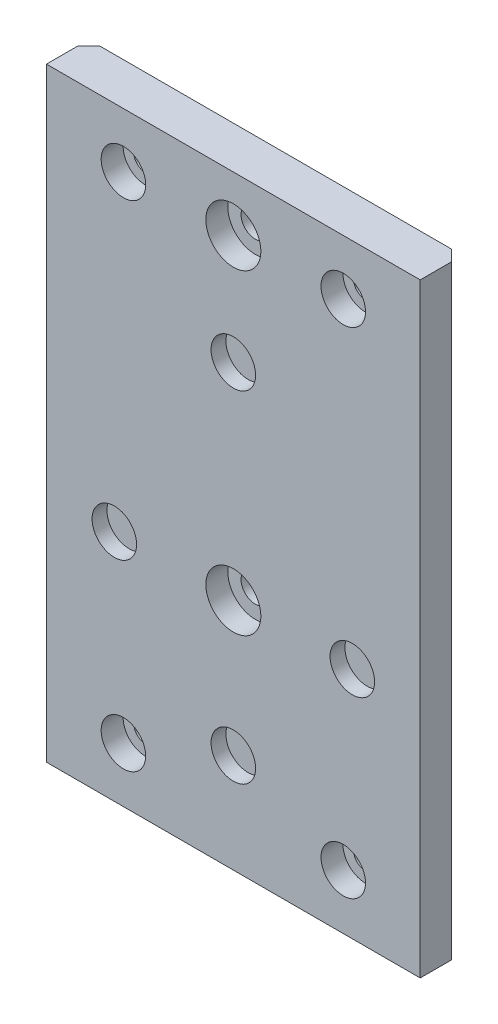
ISO-10303-21;
HEADER;
FILE_DESCRIPTION(('STEP AP214'),'2;1');
FILE_NAME('part.step','',(''),(''),'','','');
FILE_SCHEMA(('AUTOMOTIVE_DESIGN { 1 0 10303 214 1 1 1 1 }'));
ENDSEC;
DATA;
#1=APPLICATION_CONTEXT('core data for automotive mechanical design processes');
#2=APPLICATION_PROTOCOL_DEFINITION('international standard','automotive_design',2000,#1);
#3=PRODUCT_CONTEXT('',#1,'mechanical');
#4=PRODUCT('Part','Part','',(#3));
#5=PRODUCT_RELATED_PRODUCT_CATEGORY('part','',(#4));
#6=PRODUCT_DEFINITION_FORMATION('','',#4);
#7=PRODUCT_DEFINITION_CONTEXT('part definition',#1,'design');
#8=PRODUCT_DEFINITION('design','',#6,#7);
#9=PRODUCT_DEFINITION_SHAPE('','',#8);
#10=(LENGTH_UNIT() NAMED_UNIT(*) SI_UNIT(.MILLI.,.METRE.));
#11=(NAMED_UNIT(*) PLANE_ANGLE_UNIT() SI_UNIT($,.RADIAN.));
#12=(NAMED_UNIT(*) SI_UNIT($,.STERADIAN.) SOLID_ANGLE_UNIT());
#13=UNCERTAINTY_MEASURE_WITH_UNIT(LENGTH_MEASURE(1.E-05),#10,'distance_accuracy_value','');
#14=(GEOMETRIC_REPRESENTATION_CONTEXT(3) GLOBAL_UNCERTAINTY_ASSIGNED_CONTEXT((#13)) GLOBAL_UNIT_ASSIGNED_CONTEXT((#10,
#11,#12)) REPRESENTATION_CONTEXT('',''));
#15=CARTESIAN_POINT('',(0.,0.,0.));
#16=DIRECTION('',(0.,0.,1.));
#17=DIRECTION('',(1.,0.,0.));
#18=AXIS2_PLACEMENT_3D('',#15,#16,#17);
#19=CARTESIAN_POINT('',(0.,-36.95,7.7));
#20=DIRECTION('',(0.,0.,-1.));
#21=DIRECTION('',(-1.,0.,0.));
#22=AXIS2_PLACEMENT_3D('',#19,#20,#21);
#23=CYLINDRICAL_SURFACE('',#22,4.05);
#24=CARTESIAN_POINT('',(0.,-36.95,7.7));
#25=DIRECTION('',(0.,0.,1.));
#26=DIRECTION('',(1.,0.,0.));
#27=AXIS2_PLACEMENT_3D('',#24,#25,#26);
#28=CIRCLE('',#27,4.05);
#29=CARTESIAN_POINT('',(4.05,-36.95,7.7));
#30=VERTEX_POINT('',#29);
#31=EDGE_CURVE('E191',#30,#30,#28,.T.);
#32=ORIENTED_EDGE('',*,*,#31,.T.);
#33=EDGE_LOOP('',(#32));
#34=FACE_BOUND('',#33,.T.);
#35=CARTESIAN_POINT('',(0.,-36.95,5.));
#36=DIRECTION('',(0.,0.,-1.));
#37=DIRECTION('',(-1.,0.,0.));
#38=AXIS2_PLACEMENT_3D('',#35,#36,#37);
#39=CIRCLE('',#38,4.05);
#40=CARTESIAN_POINT('',(-4.05,-36.95,5.));
#41=VERTEX_POINT('',#40);
#42=EDGE_CURVE('E136',#41,#41,#39,.T.);
#43=ORIENTED_EDGE('',*,*,#42,.T.);
#44=EDGE_LOOP('',(#43));
#45=FACE_BOUND('',#44,.T.);
#46=ADVANCED_FACE('F32',(#34,#45),#23,.F.);
#47=CARTESIAN_POINT('',(-21.650635094611,-12.5,7.7));
#48=DIRECTION('',(0.,0.,-1.));
#49=DIRECTION('',(-1.,0.,0.));
#50=AXIS2_PLACEMENT_3D('',#47,#48,#49);
#51=CYLINDRICAL_SURFACE('',#50,4.05);
#52=CARTESIAN_POINT('',(-21.650635094611,-12.5,7.7));
#53=DIRECTION('',(0.,0.,1.));
#54=DIRECTION('',(1.,0.,0.));
#55=AXIS2_PLACEMENT_3D('',#52,#53,#54);
#56=CIRCLE('',#55,4.05);
#57=CARTESIAN_POINT('',(-17.600635094611,-12.5,7.7));
#58=VERTEX_POINT('',#57);
#59=EDGE_CURVE('E199',#58,#58,#56,.T.);
#60=ORIENTED_EDGE('',*,*,#59,.T.);
#61=EDGE_LOOP('',(#60));
#62=FACE_BOUND('',#61,.T.);
#63=CARTESIAN_POINT('',(-21.650635094611,-12.5,5.));
#64=DIRECTION('',(0.,0.,-1.));
#65=DIRECTION('',(-1.,0.,0.));
#66=AXIS2_PLACEMENT_3D('',#63,#64,#65);
#67=CIRCLE('',#66,4.05);
#68=CARTESIAN_POINT('',(-25.700635094611,-12.5,5.));
#69=VERTEX_POINT('',#68);
#70=EDGE_CURVE('E133',#69,#69,#67,.T.);
#71=ORIENTED_EDGE('',*,*,#70,.T.);
#72=EDGE_LOOP('',(#71));
#73=FACE_BOUND('',#72,.T.);
#74=ADVANCED_FACE('F287',(#62,#73),#51,.F.);
#75=CARTESIAN_POINT('',(0.,25.,7.7));
#76=DIRECTION('',(0.,0.,-1.));
#77=DIRECTION('',(-1.,0.,0.));
#78=AXIS2_PLACEMENT_3D('',#75,#76,#77);
#79=CYLINDRICAL_SURFACE('',#78,4.05);
#80=CARTESIAN_POINT('',(0.,25.,7.7));
#81=DIRECTION('',(0.,0.,1.));
#82=DIRECTION('',(1.,0.,0.));
#83=AXIS2_PLACEMENT_3D('',#80,#81,#82);
#84=CIRCLE('',#83,4.05);
#85=CARTESIAN_POINT('',(4.04999999999999,25.,7.7));
#86=VERTEX_POINT('',#85);
#87=EDGE_CURVE('E202',#86,#86,#84,.T.);
#88=ORIENTED_EDGE('',*,*,#87,.T.);
#89=EDGE_LOOP('',(#88));
#90=FACE_BOUND('',#89,.T.);
#91=CARTESIAN_POINT('',(0.,25.,5.));
#92=DIRECTION('',(0.,0.,-1.));
#93=DIRECTION('',(-1.,0.,0.));
#94=AXIS2_PLACEMENT_3D('',#91,#92,#93);
#95=CIRCLE('',#94,4.05);
#96=CARTESIAN_POINT('',(-4.05000000000001,25.,5.));
#97=VERTEX_POINT('',#96);
#98=EDGE_CURVE('E130',#97,#97,#95,.T.);
#99=ORIENTED_EDGE('',*,*,#98,.T.);
#100=EDGE_LOOP('',(#99));
#101=FACE_BOUND('',#100,.T.);
#102=ADVANCED_FACE('F293',(#90,#101),#79,.F.);
#103=CARTESIAN_POINT('',(21.650635094611,-12.5,7.7));
#104=DIRECTION('',(0.,0.,-1.));
#105=DIRECTION('',(-1.,0.,0.));
#106=AXIS2_PLACEMENT_3D('',#103,#104,#105);
#107=CYLINDRICAL_SURFACE('',#106,4.05);
#108=CARTESIAN_POINT('',(21.650635094611,-12.5,7.7));
#109=DIRECTION('',(0.,0.,1.));
#110=DIRECTION('',(1.,0.,0.));
#111=AXIS2_PLACEMENT_3D('',#108,#109,#110);
#112=CIRCLE('',#111,4.05);
#113=CARTESIAN_POINT('',(25.700635094611,-12.5,7.7));
#114=VERTEX_POINT('',#113);
#115=EDGE_CURVE('E205',#114,#114,#112,.T.);
#116=ORIENTED_EDGE('',*,*,#115,.T.);
#117=EDGE_LOOP('',(#116));
#118=FACE_BOUND('',#117,.T.);
#119=CARTESIAN_POINT('',(21.650635094611,-12.5,5.));
#120=DIRECTION('',(0.,0.,-1.));
#121=DIRECTION('',(-1.,0.,0.));
#122=AXIS2_PLACEMENT_3D('',#119,#120,#121);
#123=CIRCLE('',#122,4.05);
#124=CARTESIAN_POINT('',(17.600635094611,-12.5,5.));
#125=VERTEX_POINT('',#124);
#126=EDGE_CURVE('E126',#125,#125,#123,.T.);
#127=ORIENTED_EDGE('',*,*,#126,.T.);
#128=EDGE_LOOP('',(#127));
#129=FACE_BOUND('',#128,.T.);
#130=ADVANCED_FACE('F303',(#118,#129),#107,.F.);
#131=CARTESIAN_POINT('',(0.,0.,7.7));
#132=DIRECTION('',(0.,0.,1.));
#133=DIRECTION('',(1.,0.,0.));
#134=AXIS2_PLACEMENT_3D('',#131,#132,#133);
#135=PLANE('',#134);
#136=CARTESIAN_POINT('',(0.,45.,7.7));
#137=DIRECTION('',(0.,0.,-1.));
#138=DIRECTION('',(-1.,0.,0.));
#139=AXIS2_PLACEMENT_3D('',#136,#137,#138);
#140=CIRCLE('',#139,5.);
#141=CARTESIAN_POINT('',(-5.00000000000001,45.,7.7));
#142=VERTEX_POINT('',#141);
#143=EDGE_CURVE('E240',#142,#142,#140,.T.);
#144=ORIENTED_EDGE('',*,*,#143,.T.);
#145=EDGE_LOOP('',(#144));
#146=FACE_BOUND('',#145,.T.);
#147=CARTESIAN_POINT('',(-20.,-45.,7.7));
#148=DIRECTION('',(0.,0.,-1.));
#149=DIRECTION('',(-1.,0.,0.));
#150=AXIS2_PLACEMENT_3D('',#147,#148,#149);
#151=CIRCLE('',#150,4.05);
#152=CARTESIAN_POINT('',(-24.05,-45.,7.7));
#153=VERTEX_POINT('',#152);
#154=EDGE_CURVE('E247',#153,#153,#151,.T.);
#155=ORIENTED_EDGE('',*,*,#154,.T.);
#156=EDGE_LOOP('',(#155));
#157=FACE_BOUND('',#156,.T.);
#158=CARTESIAN_POINT('',(20.,-45.,7.7));
#159=DIRECTION('',(0.,0.,-1.));
#160=DIRECTION('',(-1.,0.,0.));
#161=AXIS2_PLACEMENT_3D('',#158,#159,#160);
#162=CIRCLE('',#161,4.05);
#163=CARTESIAN_POINT('',(15.95,-45.,7.7));
#164=VERTEX_POINT('',#163);
#165=EDGE_CURVE('E246',#164,#164,#162,.T.);
#166=ORIENTED_EDGE('',*,*,#165,.T.);
#167=EDGE_LOOP('',(#166));
#168=FACE_BOUND('',#167,.T.);
#169=CARTESIAN_POINT('',(-20.,45.,7.7));
#170=DIRECTION('',(0.,0.,-1.));
#171=DIRECTION('',(-1.,0.,0.));
#172=AXIS2_PLACEMENT_3D('',#169,#170,#171);
#173=CIRCLE('',#172,4.05);
#174=CARTESIAN_POINT('',(-24.05,45.,7.7));
#175=VERTEX_POINT('',#174);
#176=EDGE_CURVE('E258',#175,#175,#173,.T.);
#177=ORIENTED_EDGE('',*,*,#176,.T.);
#178=EDGE_LOOP('',(#177));
#179=FACE_BOUND('',#178,.T.);
#180=CARTESIAN_POINT('',(0.,-12.5,7.7));
#181=DIRECTION('',(0.,0.,-1.));
#182=DIRECTION('',(-1.,0.,0.));
#183=AXIS2_PLACEMENT_3D('',#180,#181,#182);
#184=CIRCLE('',#183,5.);
#185=CARTESIAN_POINT('',(-5.00000000000001,-12.5,7.7));
#186=VERTEX_POINT('',#185);
#187=EDGE_CURVE('E232',#186,#186,#184,.T.);
#188=ORIENTED_EDGE('',*,*,#187,.T.);
#189=EDGE_LOOP('',(#188));
#190=FACE_BOUND('',#189,.T.);
#191=CARTESIAN_POINT('',(20.,45.,7.7));
#192=DIRECTION('',(0.,0.,-1.));
#193=DIRECTION('',(-1.,0.,0.));
#194=AXIS2_PLACEMENT_3D('',#191,#192,#193);
#195=CIRCLE('',#194,4.05);
#196=CARTESIAN_POINT('',(15.95,45.,7.7));
#197=VERTEX_POINT('',#196);
#198=EDGE_CURVE('E194',#197,#197,#195,.T.);
#199=ORIENTED_EDGE('',*,*,#198,.T.);
#200=EDGE_LOOP('',(#199));
#201=FACE_BOUND('',#200,.T.);
#202=ORIENTED_EDGE('',*,*,#59,.F.);
#203=EDGE_LOOP('',(#202));
#204=FACE_BOUND('',#203,.T.);
#205=ORIENTED_EDGE('',*,*,#115,.F.);
#206=EDGE_LOOP('',(#205));
#207=FACE_BOUND('',#206,.T.);
#208=DIRECTION('',(0.,1.,0.));
#209=VECTOR('',#208,1.);
#210=CARTESIAN_POINT('',(34.,55.,7.7));
#211=LINE('',#210,#209);
#212=CARTESIAN_POINT('',(34.,-55.,7.7));
#213=VERTEX_POINT('',#212);
#214=CARTESIAN_POINT('',(34.,55.,7.7));
#215=VERTEX_POINT('',#214);
#216=EDGE_CURVE('E110',#213,#215,#211,.T.);
#217=ORIENTED_EDGE('',*,*,#216,.T.);
#218=DIRECTION('',(-1.,0.,0.));
#219=VECTOR('',#218,1.);
#220=CARTESIAN_POINT('',(-34.,55.,7.7));
#221=LINE('',#220,#219);
#222=CARTESIAN_POINT('',(-34.,55.,7.7));
#223=VERTEX_POINT('',#222);
#224=EDGE_CURVE('E213',#215,#223,#221,.T.);
#225=ORIENTED_EDGE('',*,*,#224,.T.);
#226=DIRECTION('',(0.,-1.,0.));
#227=VECTOR('',#226,1.);
#228=CARTESIAN_POINT('',(-34.,55.,7.7));
#229=LINE('',#228,#227);
#230=CARTESIAN_POINT('',(-34.,-55.,7.7));
#231=VERTEX_POINT('',#230);
#232=EDGE_CURVE('E214',#223,#231,#229,.T.);
#233=ORIENTED_EDGE('',*,*,#232,.T.);
#234=DIRECTION('',(1.,0.,0.));
#235=VECTOR('',#234,1.);
#236=CARTESIAN_POINT('',(-34.,-55.,7.7));
#237=LINE('',#236,#235);
#238=EDGE_CURVE('E116',#231,#213,#237,.T.);
#239=ORIENTED_EDGE('',*,*,#238,.T.);
#240=EDGE_LOOP('',(#217,#225,#233,#239));
#241=FACE_BOUND('',#240,.T.);
#242=ORIENTED_EDGE('',*,*,#87,.F.);
#243=EDGE_LOOP('',(#242));
#244=FACE_BOUND('',#243,.T.);
#245=ORIENTED_EDGE('',*,*,#31,.F.);
#246=EDGE_LOOP('',(#245));
#247=FACE_BOUND('',#246,.T.);
#248=ADVANCED_FACE('F170',(#146,#157,#168,#179,#190,#201,#204,#207,#241,#244,#247),#135,.T.);
#249=CARTESIAN_POINT('',(0.,0.,0.));
#250=DIRECTION('',(0.,0.,1.));
#251=DIRECTION('',(1.,0.,0.));
#252=AXIS2_PLACEMENT_3D('',#249,#250,#251);
#253=PLANE('',#252);
#254=DIRECTION('',(1.,0.,0.));
#255=VECTOR('',#254,1.);
#256=CARTESIAN_POINT('',(-34.,-55.,0.));
#257=LINE('',#256,#255);
#258=CARTESIAN_POINT('',(-32.,-55.,0.));
#259=VERTEX_POINT('',#258);
#260=CARTESIAN_POINT('',(32.,-55.,0.));
#261=VERTEX_POINT('',#260);
#262=EDGE_CURVE('E103',#259,#261,#257,.T.);
#263=ORIENTED_EDGE('',*,*,#262,.F.);
#264=DIRECTION('',(0.,-1.,0.));
#265=VECTOR('',#264,1.);
#266=CARTESIAN_POINT('',(-32.,55.,0.));
#267=LINE('',#266,#265);
#268=CARTESIAN_POINT('',(-32.,55.,0.));
#269=VERTEX_POINT('',#268);
#270=EDGE_CURVE('E57',#269,#259,#267,.T.);
#271=ORIENTED_EDGE('',*,*,#270,.F.);
#272=DIRECTION('',(-1.,0.,0.));
#273=VECTOR('',#272,1.);
#274=CARTESIAN_POINT('',(-34.,55.,0.));
#275=LINE('',#274,#273);
#276=CARTESIAN_POINT('',(32.,55.,0.));
#277=VERTEX_POINT('',#276);
#278=EDGE_CURVE('E101',#277,#269,#275,.T.);
#279=ORIENTED_EDGE('',*,*,#278,.F.);
#280=DIRECTION('',(0.,-1.,0.));
#281=VECTOR('',#280,1.);
#282=CARTESIAN_POINT('',(32.,55.,0.));
#283=LINE('',#282,#281);
#284=EDGE_CURVE('E229',#277,#261,#283,.T.);
#285=ORIENTED_EDGE('',*,*,#284,.T.);
#286=EDGE_LOOP('',(#263,#271,#279,#285));
#287=FACE_BOUND('',#286,.T.);
#288=CARTESIAN_POINT('',(20.,45.,0.));
#289=DIRECTION('',(0.,0.,1.));
#290=DIRECTION('',(1.,0.,0.));
#291=AXIS2_PLACEMENT_3D('',#288,#289,#290);
#292=CIRCLE('',#291,2.1);
#293=CARTESIAN_POINT('',(22.1,45.,0.));
#294=VERTEX_POINT('',#293);
#295=EDGE_CURVE('E108',#294,#294,#292,.T.);
#296=ORIENTED_EDGE('',*,*,#295,.T.);
#297=EDGE_LOOP('',(#296));
#298=FACE_BOUND('',#297,.T.);
#299=CARTESIAN_POINT('',(-20.,45.,0.));
#300=DIRECTION('',(0.,0.,1.));
#301=DIRECTION('',(1.,0.,0.));
#302=AXIS2_PLACEMENT_3D('',#299,#300,#301);
#303=CIRCLE('',#302,2.1);
#304=CARTESIAN_POINT('',(-17.9,45.,0.));
#305=VERTEX_POINT('',#304);
#306=EDGE_CURVE('E113',#305,#305,#303,.T.);
#307=ORIENTED_EDGE('',*,*,#306,.T.);
#308=EDGE_LOOP('',(#307));
#309=FACE_BOUND('',#308,.T.);
#310=CARTESIAN_POINT('',(20.,-45.,0.));
#311=DIRECTION('',(0.,0.,1.));
#312=DIRECTION('',(1.,0.,0.));
#313=AXIS2_PLACEMENT_3D('',#310,#311,#312);
#314=CIRCLE('',#313,2.1);
#315=CARTESIAN_POINT('',(22.1,-45.,0.));
#316=VERTEX_POINT('',#315);
#317=EDGE_CURVE('E178',#316,#316,#314,.T.);
#318=ORIENTED_EDGE('',*,*,#317,.T.);
#319=EDGE_LOOP('',(#318));
#320=FACE_BOUND('',#319,.T.);
#321=CARTESIAN_POINT('',(-20.,-45.,0.));
#322=DIRECTION('',(0.,0.,1.));
#323=DIRECTION('',(1.,0.,0.));
#324=AXIS2_PLACEMENT_3D('',#321,#322,#323);
#325=CIRCLE('',#324,2.1);
#326=CARTESIAN_POINT('',(-17.9,-45.,0.));
#327=VERTEX_POINT('',#326);
#328=EDGE_CURVE('E182',#327,#327,#325,.T.);
#329=ORIENTED_EDGE('',*,*,#328,.T.);
#330=EDGE_LOOP('',(#329));
#331=FACE_BOUND('',#330,.T.);
#332=CARTESIAN_POINT('',(0.,45.,0.));
#333=DIRECTION('',(0.,0.,1.));
#334=DIRECTION('',(1.,0.,0.));
#335=AXIS2_PLACEMENT_3D('',#332,#333,#334);
#336=CIRCLE('',#335,2.6);
#337=CARTESIAN_POINT('',(2.59999999999999,45.,0.));
#338=VERTEX_POINT('',#337);
#339=EDGE_CURVE('E186',#338,#338,#336,.T.);
#340=ORIENTED_EDGE('',*,*,#339,.T.);
#341=EDGE_LOOP('',(#340));
#342=FACE_BOUND('',#341,.T.);
#343=CARTESIAN_POINT('',(0.,-12.5,0.));
#344=DIRECTION('',(0.,0.,1.));
#345=DIRECTION('',(1.,0.,0.));
#346=AXIS2_PLACEMENT_3D('',#343,#344,#345);
#347=CIRCLE('',#346,2.6);
#348=CARTESIAN_POINT('',(2.59999999999999,-12.5,0.));
#349=VERTEX_POINT('',#348);
#350=EDGE_CURVE('E129',#349,#349,#347,.T.);
#351=ORIENTED_EDGE('',*,*,#350,.T.);
#352=EDGE_LOOP('',(#351));
#353=FACE_BOUND('',#352,.T.);
#354=ADVANCED_FACE('F98',(#287,#298,#309,#320,#331,#342,#353),#253,.F.);
#355=CARTESIAN_POINT('',(34.,55.,7.7));
#356=DIRECTION('',(-1.,0.,0.));
#357=DIRECTION('',(0.,-1.,0.));
#358=AXIS2_PLACEMENT_3D('',#355,#356,#357);
#359=PLANE('',#358);
#360=DIRECTION('',(0.,0.,-1.));
#361=VECTOR('',#360,1.);
#362=CARTESIAN_POINT('',(34.,-55.,7.7));
#363=LINE('',#362,#361);
#364=CARTESIAN_POINT('',(34.,-55.,1.99999999999995));
#365=VERTEX_POINT('',#364);
#366=EDGE_CURVE('E119',#213,#365,#363,.T.);
#367=ORIENTED_EDGE('',*,*,#366,.T.);
#368=DIRECTION('',(0.,-1.,0.));
#369=VECTOR('',#368,1.);
#370=CARTESIAN_POINT('',(34.,55.,1.99999999999995));
#371=LINE('',#370,#369);
#372=CARTESIAN_POINT('',(34.,55.,1.99999999999995));
#373=VERTEX_POINT('',#372);
#374=EDGE_CURVE('E49',#373,#365,#371,.T.);
#375=ORIENTED_EDGE('',*,*,#374,.F.);
#376=DIRECTION('',(0.,0.,-1.));
#377=VECTOR('',#376,1.);
#378=CARTESIAN_POINT('',(34.,55.,7.7));
#379=LINE('',#378,#377);
#380=EDGE_CURVE('E11',#215,#373,#379,.T.);
#381=ORIENTED_EDGE('',*,*,#380,.F.);
#382=ORIENTED_EDGE('',*,*,#216,.F.);
#383=EDGE_LOOP('',(#367,#375,#381,#382));
#384=FACE_BOUND('',#383,.T.);
#385=ADVANCED_FACE('F34',(#384),#359,.F.);
#386=CARTESIAN_POINT('',(-34.,55.,7.7));
#387=DIRECTION('',(0.,-1.,0.));
#388=DIRECTION('',(0.,0.,-1.));
#389=AXIS2_PLACEMENT_3D('',#386,#387,#388);
#390=PLANE('',#389);
#391=ORIENTED_EDGE('',*,*,#278,.T.);
#392=DIRECTION('',(-0.707106781186541,0.,0.707106781186554));
#393=VECTOR('',#392,1.);
#394=CARTESIAN_POINT('',(-32.,55.,0.));
#395=LINE('',#394,#393);
#396=CARTESIAN_POINT('',(-34.,55.,2.00000000000004));
#397=VERTEX_POINT('',#396);
#398=EDGE_CURVE('E85',#269,#397,#395,.T.);
#399=ORIENTED_EDGE('',*,*,#398,.T.);
#400=DIRECTION('',(0.,0.,-1.));
#401=VECTOR('',#400,1.);
#402=CARTESIAN_POINT('',(-34.,55.,7.7));
#403=LINE('',#402,#401);
#404=EDGE_CURVE('E41',#223,#397,#403,.T.);
#405=ORIENTED_EDGE('',*,*,#404,.F.);
#406=ORIENTED_EDGE('',*,*,#224,.F.);
#407=ORIENTED_EDGE('',*,*,#380,.T.);
#408=DIRECTION('',(-0.707106781186556,0.,-0.707106781186539));
#409=VECTOR('',#408,1.);
#410=CARTESIAN_POINT('',(32.,55.,0.));
#411=LINE('',#410,#409);
#412=EDGE_CURVE('E107',#373,#277,#411,.T.);
#413=ORIENTED_EDGE('',*,*,#412,.T.);
#414=EDGE_LOOP('',(#391,#399,#405,#406,#407,#413));
#415=FACE_BOUND('',#414,.T.);
#416=ADVANCED_FACE('F106',(#415),#390,.F.);
#417=CARTESIAN_POINT('',(-34.,55.,7.7));
#418=DIRECTION('',(1.,0.,0.));
#419=DIRECTION('',(0.,1.,0.));
#420=AXIS2_PLACEMENT_3D('',#417,#418,#419);
#421=PLANE('',#420);
#422=ORIENTED_EDGE('',*,*,#404,.T.);
#423=DIRECTION('',(0.,-1.,0.));
#424=VECTOR('',#423,1.);
#425=CARTESIAN_POINT('',(-34.,55.,2.00000000000004));
#426=LINE('',#425,#424);
#427=CARTESIAN_POINT('',(-34.,-55.,2.00000000000004));
#428=VERTEX_POINT('',#427);
#429=EDGE_CURVE('E88',#397,#428,#426,.T.);
#430=ORIENTED_EDGE('',*,*,#429,.T.);
#431=DIRECTION('',(0.,0.,-1.));
#432=VECTOR('',#431,1.);
#433=CARTESIAN_POINT('',(-34.,-55.,7.7));
#434=LINE('',#433,#432);
#435=EDGE_CURVE('E122',#231,#428,#434,.T.);
#436=ORIENTED_EDGE('',*,*,#435,.F.);
#437=ORIENTED_EDGE('',*,*,#232,.F.);
#438=EDGE_LOOP('',(#422,#430,#436,#437));
#439=FACE_BOUND('',#438,.T.);
#440=ADVANCED_FACE('F227',(#439),#421,.F.);
#441=CARTESIAN_POINT('',(-34.,-55.,7.7));
#442=DIRECTION('',(0.,1.,0.));
#443=DIRECTION('',(0.,0.,1.));
#444=AXIS2_PLACEMENT_3D('',#441,#442,#443);
#445=PLANE('',#444);
#446=ORIENTED_EDGE('',*,*,#435,.T.);
#447=DIRECTION('',(-0.707106781186541,0.,0.707106781186554));
#448=VECTOR('',#447,1.);
#449=CARTESIAN_POINT('',(-32.,-55.,0.));
#450=LINE('',#449,#448);
#451=EDGE_CURVE('E93',#259,#428,#450,.T.);
#452=ORIENTED_EDGE('',*,*,#451,.F.);
#453=ORIENTED_EDGE('',*,*,#262,.T.);
#454=DIRECTION('',(-0.707106781186556,0.,-0.707106781186539));
#455=VECTOR('',#454,1.);
#456=CARTESIAN_POINT('',(32.,-55.,0.));
#457=LINE('',#456,#455);
#458=EDGE_CURVE('E224',#365,#261,#457,.T.);
#459=ORIENTED_EDGE('',*,*,#458,.F.);
#460=ORIENTED_EDGE('',*,*,#366,.F.);
#461=ORIENTED_EDGE('',*,*,#238,.F.);
#462=EDGE_LOOP('',(#446,#452,#453,#459,#460,#461));
#463=FACE_BOUND('',#462,.T.);
#464=ADVANCED_FACE('F165',(#463),#445,.F.);
#465=CARTESIAN_POINT('',(20.,45.,7.7));
#466=DIRECTION('',(0.,0.,-1.));
#467=DIRECTION('',(-1.,0.,0.));
#468=AXIS2_PLACEMENT_3D('',#465,#466,#467);
#469=CYLINDRICAL_SURFACE('',#468,2.1);
#470=CARTESIAN_POINT('',(20.,45.,3.7));
#471=DIRECTION('',(0.,0.,-1.));
#472=DIRECTION('',(-1.,0.,0.));
#473=AXIS2_PLACEMENT_3D('',#470,#471,#472);
#474=CIRCLE('',#473,2.1);
#475=CARTESIAN_POINT('',(17.9,45.,3.7));
#476=VERTEX_POINT('',#475);
#477=EDGE_CURVE('E36',#476,#476,#474,.T.);
#478=ORIENTED_EDGE('',*,*,#477,.F.);
#479=EDGE_LOOP('',(#478));
#480=FACE_BOUND('',#479,.T.);
#481=ORIENTED_EDGE('',*,*,#295,.F.);
#482=EDGE_LOOP('',(#481));
#483=FACE_BOUND('',#482,.T.);
#484=ADVANCED_FACE('F161',(#480,#483),#469,.F.);
#485=CARTESIAN_POINT('',(-20.,45.,7.7));
#486=DIRECTION('',(0.,0.,-1.));
#487=DIRECTION('',(-1.,0.,0.));
#488=AXIS2_PLACEMENT_3D('',#485,#486,#487);
#489=CYLINDRICAL_SURFACE('',#488,2.1);
#490=CARTESIAN_POINT('',(-20.,45.,3.7));
#491=DIRECTION('',(0.,0.,-1.));
#492=DIRECTION('',(-1.,0.,0.));
#493=AXIS2_PLACEMENT_3D('',#490,#491,#492);
#494=CIRCLE('',#493,2.1);
#495=CARTESIAN_POINT('',(-22.1,45.,3.7));
#496=VERTEX_POINT('',#495);
#497=EDGE_CURVE('E151',#496,#496,#494,.T.);
#498=ORIENTED_EDGE('',*,*,#497,.F.);
#499=EDGE_LOOP('',(#498));
#500=FACE_BOUND('',#499,.T.);
#501=ORIENTED_EDGE('',*,*,#306,.F.);
#502=EDGE_LOOP('',(#501));
#503=FACE_BOUND('',#502,.T.);
#504=ADVANCED_FACE('F164',(#500,#503),#489,.F.);
#505=CARTESIAN_POINT('',(20.,-45.,7.7));
#506=DIRECTION('',(0.,0.,-1.));
#507=DIRECTION('',(-1.,0.,0.));
#508=AXIS2_PLACEMENT_3D('',#505,#506,#507);
#509=CYLINDRICAL_SURFACE('',#508,2.1);
#510=CARTESIAN_POINT('',(20.,-45.,3.7));
#511=DIRECTION('',(0.,0.,-1.));
#512=DIRECTION('',(-1.,0.,0.));
#513=AXIS2_PLACEMENT_3D('',#510,#511,#512);
#514=CIRCLE('',#513,2.1);
#515=CARTESIAN_POINT('',(17.9,-45.,3.7));
#516=VERTEX_POINT('',#515);
#517=EDGE_CURVE('E149',#516,#516,#514,.T.);
#518=ORIENTED_EDGE('',*,*,#517,.F.);
#519=EDGE_LOOP('',(#518));
#520=FACE_BOUND('',#519,.T.);
#521=ORIENTED_EDGE('',*,*,#317,.F.);
#522=EDGE_LOOP('',(#521));
#523=FACE_BOUND('',#522,.T.);
#524=ADVANCED_FACE('F311',(#520,#523),#509,.F.);
#525=CARTESIAN_POINT('',(-20.,-45.,7.7));
#526=DIRECTION('',(0.,0.,-1.));
#527=DIRECTION('',(-1.,0.,0.));
#528=AXIS2_PLACEMENT_3D('',#525,#526,#527);
#529=CYLINDRICAL_SURFACE('',#528,2.1);
#530=CARTESIAN_POINT('',(-20.,-45.,3.7));
#531=DIRECTION('',(0.,0.,-1.));
#532=DIRECTION('',(-1.,0.,0.));
#533=AXIS2_PLACEMENT_3D('',#530,#531,#532);
#534=CIRCLE('',#533,2.1);
#535=CARTESIAN_POINT('',(-22.1,-45.,3.7));
#536=VERTEX_POINT('',#535);
#537=EDGE_CURVE('E146',#536,#536,#534,.T.);
#538=ORIENTED_EDGE('',*,*,#537,.F.);
#539=EDGE_LOOP('',(#538));
#540=FACE_BOUND('',#539,.T.);
#541=ORIENTED_EDGE('',*,*,#328,.F.);
#542=EDGE_LOOP('',(#541));
#543=FACE_BOUND('',#542,.T.);
#544=ADVANCED_FACE('F308',(#540,#543),#529,.F.);
#545=CARTESIAN_POINT('',(0.,45.,7.7));
#546=DIRECTION('',(0.,0.,-1.));
#547=DIRECTION('',(-1.,0.,0.));
#548=AXIS2_PLACEMENT_3D('',#545,#546,#547);
#549=CYLINDRICAL_SURFACE('',#548,2.6);
#550=CARTESIAN_POINT('',(0.,45.,3.7));
#551=DIRECTION('',(0.,0.,-1.));
#552=DIRECTION('',(-1.,0.,0.));
#553=AXIS2_PLACEMENT_3D('',#550,#551,#552);
#554=CIRCLE('',#553,2.6);
#555=CARTESIAN_POINT('',(-2.60000000000001,45.,3.7));
#556=VERTEX_POINT('',#555);
#557=EDGE_CURVE('E142',#556,#556,#554,.T.);
#558=ORIENTED_EDGE('',*,*,#557,.F.);
#559=EDGE_LOOP('',(#558));
#560=FACE_BOUND('',#559,.T.);
#561=ORIENTED_EDGE('',*,*,#339,.F.);
#562=EDGE_LOOP('',(#561));
#563=FACE_BOUND('',#562,.T.);
#564=ADVANCED_FACE('F298',(#560,#563),#549,.F.);
#565=CARTESIAN_POINT('',(0.,-12.5,7.7));
#566=DIRECTION('',(0.,0.,-1.));
#567=DIRECTION('',(-1.,0.,0.));
#568=AXIS2_PLACEMENT_3D('',#565,#566,#567);
#569=CYLINDRICAL_SURFACE('',#568,2.6);
#570=CARTESIAN_POINT('',(0.,-12.5,3.7));
#571=DIRECTION('',(0.,0.,-1.));
#572=DIRECTION('',(-1.,0.,0.));
#573=AXIS2_PLACEMENT_3D('',#570,#571,#572);
#574=CIRCLE('',#573,2.6);
#575=CARTESIAN_POINT('',(-2.60000000000001,-12.5,3.7));
#576=VERTEX_POINT('',#575);
#577=EDGE_CURVE('E139',#576,#576,#574,.T.);
#578=ORIENTED_EDGE('',*,*,#577,.F.);
#579=EDGE_LOOP('',(#578));
#580=FACE_BOUND('',#579,.T.);
#581=ORIENTED_EDGE('',*,*,#350,.F.);
#582=EDGE_LOOP('',(#581));
#583=FACE_BOUND('',#582,.T.);
#584=ADVANCED_FACE('F448',(#580,#583),#569,.F.);
#585=CARTESIAN_POINT('',(21.650635094611,-12.5,5.));
#586=DIRECTION('',(0.,0.,-1.));
#587=DIRECTION('',(-1.,0.,0.));
#588=AXIS2_PLACEMENT_3D('',#585,#586,#587);
#589=PLANE('',#588);
#590=ORIENTED_EDGE('',*,*,#126,.F.);
#591=EDGE_LOOP('',(#590));
#592=FACE_BOUND('',#591,.T.);
#593=ADVANCED_FACE('F453',(#592),#589,.F.);
#594=CARTESIAN_POINT('',(0.,25.,5.));
#595=DIRECTION('',(0.,0.,-1.));
#596=DIRECTION('',(-1.,0.,0.));
#597=AXIS2_PLACEMENT_3D('',#594,#595,#596);
#598=PLANE('',#597);
#599=ORIENTED_EDGE('',*,*,#98,.F.);
#600=EDGE_LOOP('',(#599));
#601=FACE_BOUND('',#600,.T.);
#602=ADVANCED_FACE('F512',(#601),#598,.F.);
#603=CARTESIAN_POINT('',(-21.650635094611,-12.5,5.));
#604=DIRECTION('',(0.,0.,-1.));
#605=DIRECTION('',(-1.,0.,0.));
#606=AXIS2_PLACEMENT_3D('',#603,#604,#605);
#607=PLANE('',#606);
#608=ORIENTED_EDGE('',*,*,#70,.F.);
#609=EDGE_LOOP('',(#608));
#610=FACE_BOUND('',#609,.T.);
#611=ADVANCED_FACE('F503',(#610),#607,.F.);
#612=CARTESIAN_POINT('',(0.,-36.95,5.));
#613=DIRECTION('',(0.,0.,-1.));
#614=DIRECTION('',(-1.,0.,0.));
#615=AXIS2_PLACEMENT_3D('',#612,#613,#614);
#616=PLANE('',#615);
#617=ORIENTED_EDGE('',*,*,#42,.F.);
#618=EDGE_LOOP('',(#617));
#619=FACE_BOUND('',#618,.T.);
#620=ADVANCED_FACE('F440',(#619),#616,.F.);
#621=CARTESIAN_POINT('',(0.,-12.5,3.7));
#622=DIRECTION('',(0.,0.,1.));
#623=DIRECTION('',(1.,0.,0.));
#624=AXIS2_PLACEMENT_3D('',#621,#622,#623);
#625=CYLINDRICAL_SURFACE('',#624,5.);
#626=CARTESIAN_POINT('',(0.,-12.5,3.7));
#627=DIRECTION('',(0.,0.,-1.));
#628=DIRECTION('',(-1.,0.,0.));
#629=AXIS2_PLACEMENT_3D('',#626,#627,#628);
#630=CIRCLE('',#629,5.);
#631=CARTESIAN_POINT('',(-5.00000000000001,-12.5,3.7));
#632=VERTEX_POINT('',#631);
#633=EDGE_CURVE('E237',#632,#632,#630,.T.);
#634=ORIENTED_EDGE('',*,*,#633,.T.);
#635=EDGE_LOOP('',(#634));
#636=FACE_BOUND('',#635,.T.);
#637=ORIENTED_EDGE('',*,*,#187,.F.);
#638=EDGE_LOOP('',(#637));
#639=FACE_BOUND('',#638,.T.);
#640=ADVANCED_FACE('F430',(#636,#639),#625,.F.);
#641=CARTESIAN_POINT('',(0.,-12.5,3.7));
#642=DIRECTION('',(0.,0.,-1.));
#643=DIRECTION('',(-1.,0.,0.));
#644=AXIS2_PLACEMENT_3D('',#641,#642,#643);
#645=PLANE('',#644);
#646=ORIENTED_EDGE('',*,*,#577,.T.);
#647=EDGE_LOOP('',(#646));
#648=FACE_BOUND('',#647,.T.);
#649=ORIENTED_EDGE('',*,*,#633,.F.);
#650=EDGE_LOOP('',(#649));
#651=FACE_BOUND('',#650,.T.);
#652=ADVANCED_FACE('F420',(#648,#651),#645,.F.);
#653=CARTESIAN_POINT('',(0.,45.,3.7));
#654=DIRECTION('',(0.,0.,1.));
#655=DIRECTION('',(1.,0.,0.));
#656=AXIS2_PLACEMENT_3D('',#653,#654,#655);
#657=CYLINDRICAL_SURFACE('',#656,5.);
#658=CARTESIAN_POINT('',(0.,45.,3.7));
#659=DIRECTION('',(0.,0.,-1.));
#660=DIRECTION('',(-1.,0.,0.));
#661=AXIS2_PLACEMENT_3D('',#658,#659,#660);
#662=CIRCLE('',#661,5.);
#663=CARTESIAN_POINT('',(-5.00000000000001,45.,3.7));
#664=VERTEX_POINT('',#663);
#665=EDGE_CURVE('E250',#664,#664,#662,.T.);
#666=ORIENTED_EDGE('',*,*,#665,.T.);
#667=EDGE_LOOP('',(#666));
#668=FACE_BOUND('',#667,.T.);
#669=ORIENTED_EDGE('',*,*,#143,.F.);
#670=EDGE_LOOP('',(#669));
#671=FACE_BOUND('',#670,.T.);
#672=ADVANCED_FACE('F410',(#668,#671),#657,.F.);
#673=CARTESIAN_POINT('',(0.,45.,3.7));
#674=DIRECTION('',(0.,0.,-1.));
#675=DIRECTION('',(-1.,0.,0.));
#676=AXIS2_PLACEMENT_3D('',#673,#674,#675);
#677=PLANE('',#676);
#678=ORIENTED_EDGE('',*,*,#557,.T.);
#679=EDGE_LOOP('',(#678));
#680=FACE_BOUND('',#679,.T.);
#681=ORIENTED_EDGE('',*,*,#665,.F.);
#682=EDGE_LOOP('',(#681));
#683=FACE_BOUND('',#682,.T.);
#684=ADVANCED_FACE('F400',(#680,#683),#677,.F.);
#685=CARTESIAN_POINT('',(-20.,-45.,3.7));
#686=DIRECTION('',(0.,0.,1.));
#687=DIRECTION('',(1.,0.,0.));
#688=AXIS2_PLACEMENT_3D('',#685,#686,#687);
#689=CYLINDRICAL_SURFACE('',#688,4.05);
#690=CARTESIAN_POINT('',(-20.,-45.,3.7));
#691=DIRECTION('',(0.,0.,-1.));
#692=DIRECTION('',(-1.,0.,0.));
#693=AXIS2_PLACEMENT_3D('',#690,#691,#692);
#694=CIRCLE('',#693,4.05);
#695=CARTESIAN_POINT('',(-24.05,-45.,3.7));
#696=VERTEX_POINT('',#695);
#697=EDGE_CURVE('E243',#696,#696,#694,.T.);
#698=ORIENTED_EDGE('',*,*,#697,.T.);
#699=EDGE_LOOP('',(#698));
#700=FACE_BOUND('',#699,.T.);
#701=ORIENTED_EDGE('',*,*,#154,.F.);
#702=EDGE_LOOP('',(#701));
#703=FACE_BOUND('',#702,.T.);
#704=ADVANCED_FACE('F390',(#700,#703),#689,.F.);
#705=CARTESIAN_POINT('',(-20.,-45.,3.7));
#706=DIRECTION('',(0.,0.,-1.));
#707=DIRECTION('',(-1.,0.,0.));
#708=AXIS2_PLACEMENT_3D('',#705,#706,#707);
#709=PLANE('',#708);
#710=ORIENTED_EDGE('',*,*,#537,.T.);
#711=EDGE_LOOP('',(#710));
#712=FACE_BOUND('',#711,.T.);
#713=ORIENTED_EDGE('',*,*,#697,.F.);
#714=EDGE_LOOP('',(#713));
#715=FACE_BOUND('',#714,.T.);
#716=ADVANCED_FACE('F380',(#712,#715),#709,.F.);
#717=CARTESIAN_POINT('',(20.,-45.,3.7));
#718=DIRECTION('',(0.,0.,1.));
#719=DIRECTION('',(1.,0.,0.));
#720=AXIS2_PLACEMENT_3D('',#717,#718,#719);
#721=CYLINDRICAL_SURFACE('',#720,4.05);
#722=CARTESIAN_POINT('',(20.,-45.,3.7));
#723=DIRECTION('',(0.,0.,-1.));
#724=DIRECTION('',(-1.,0.,0.));
#725=AXIS2_PLACEMENT_3D('',#722,#723,#724);
#726=CIRCLE('',#725,4.05);
#727=CARTESIAN_POINT('',(15.95,-45.,3.7));
#728=VERTEX_POINT('',#727);
#729=EDGE_CURVE('E261',#728,#728,#726,.T.);
#730=ORIENTED_EDGE('',*,*,#729,.T.);
#731=EDGE_LOOP('',(#730));
#732=FACE_BOUND('',#731,.T.);
#733=ORIENTED_EDGE('',*,*,#165,.F.);
#734=EDGE_LOOP('',(#733));
#735=FACE_BOUND('',#734,.T.);
#736=ADVANCED_FACE('F370',(#732,#735),#721,.F.);
#737=CARTESIAN_POINT('',(20.,-45.,3.7));
#738=DIRECTION('',(0.,0.,-1.));
#739=DIRECTION('',(-1.,0.,0.));
#740=AXIS2_PLACEMENT_3D('',#737,#738,#739);
#741=PLANE('',#740);
#742=ORIENTED_EDGE('',*,*,#517,.T.);
#743=EDGE_LOOP('',(#742));
#744=FACE_BOUND('',#743,.T.);
#745=ORIENTED_EDGE('',*,*,#729,.F.);
#746=EDGE_LOOP('',(#745));
#747=FACE_BOUND('',#746,.T.);
#748=ADVANCED_FACE('F360',(#744,#747),#741,.F.);
#749=CARTESIAN_POINT('',(-20.,45.,3.7));
#750=DIRECTION('',(0.,0.,1.));
#751=DIRECTION('',(1.,0.,0.));
#752=AXIS2_PLACEMENT_3D('',#749,#750,#751);
#753=CYLINDRICAL_SURFACE('',#752,4.05);
#754=CARTESIAN_POINT('',(-20.,45.,3.7));
#755=DIRECTION('',(0.,0.,-1.));
#756=DIRECTION('',(-1.,0.,0.));
#757=AXIS2_PLACEMENT_3D('',#754,#755,#756);
#758=CIRCLE('',#757,4.05);
#759=CARTESIAN_POINT('',(-24.05,45.,3.7));
#760=VERTEX_POINT('',#759);
#761=EDGE_CURVE('E255',#760,#760,#758,.T.);
#762=ORIENTED_EDGE('',*,*,#761,.T.);
#763=EDGE_LOOP('',(#762));
#764=FACE_BOUND('',#763,.T.);
#765=ORIENTED_EDGE('',*,*,#176,.F.);
#766=EDGE_LOOP('',(#765));
#767=FACE_BOUND('',#766,.T.);
#768=ADVANCED_FACE('F283',(#764,#767),#753,.F.);
#769=CARTESIAN_POINT('',(-20.,45.,3.7));
#770=DIRECTION('',(0.,0.,-1.));
#771=DIRECTION('',(-1.,0.,0.));
#772=AXIS2_PLACEMENT_3D('',#769,#770,#771);
#773=PLANE('',#772);
#774=ORIENTED_EDGE('',*,*,#497,.T.);
#775=EDGE_LOOP('',(#774));
#776=FACE_BOUND('',#775,.T.);
#777=ORIENTED_EDGE('',*,*,#761,.F.);
#778=EDGE_LOOP('',(#777));
#779=FACE_BOUND('',#778,.T.);
#780=ADVANCED_FACE('F275',(#776,#779),#773,.F.);
#781=CARTESIAN_POINT('',(20.,45.,3.7));
#782=DIRECTION('',(0.,0.,1.));
#783=DIRECTION('',(1.,0.,0.));
#784=AXIS2_PLACEMENT_3D('',#781,#782,#783);
#785=CYLINDRICAL_SURFACE('',#784,4.05);
#786=CARTESIAN_POINT('',(20.,45.,3.7));
#787=DIRECTION('',(0.,0.,-1.));
#788=DIRECTION('',(-1.,0.,0.));
#789=AXIS2_PLACEMENT_3D('',#786,#787,#788);
#790=CIRCLE('',#789,4.05);
#791=CARTESIAN_POINT('',(15.95,45.,3.7));
#792=VERTEX_POINT('',#791);
#793=EDGE_CURVE('E143',#792,#792,#790,.T.);
#794=ORIENTED_EDGE('',*,*,#793,.T.);
#795=EDGE_LOOP('',(#794));
#796=FACE_BOUND('',#795,.T.);
#797=ORIENTED_EDGE('',*,*,#198,.F.);
#798=EDGE_LOOP('',(#797));
#799=FACE_BOUND('',#798,.T.);
#800=ADVANCED_FACE('F273',(#796,#799),#785,.F.);
#801=CARTESIAN_POINT('',(20.,45.,3.7));
#802=DIRECTION('',(0.,0.,-1.));
#803=DIRECTION('',(-1.,0.,0.));
#804=AXIS2_PLACEMENT_3D('',#801,#802,#803);
#805=PLANE('',#804);
#806=ORIENTED_EDGE('',*,*,#477,.T.);
#807=EDGE_LOOP('',(#806));
#808=FACE_BOUND('',#807,.T.);
#809=ORIENTED_EDGE('',*,*,#793,.F.);
#810=EDGE_LOOP('',(#809));
#811=FACE_BOUND('',#810,.T.);
#812=ADVANCED_FACE('F158',(#808,#811),#805,.F.);
#813=CARTESIAN_POINT('',(32.,55.,0.));
#814=DIRECTION('',(-0.707106781186539,0.,0.707106781186556));
#815=DIRECTION('',(0.707106781186556,0.,0.707106781186539));
#816=AXIS2_PLACEMENT_3D('',#813,#814,#815);
#817=PLANE('',#816);
#818=ORIENTED_EDGE('',*,*,#458,.T.);
#819=ORIENTED_EDGE('',*,*,#284,.F.);
#820=ORIENTED_EDGE('',*,*,#412,.F.);
#821=ORIENTED_EDGE('',*,*,#374,.T.);
#822=EDGE_LOOP('',(#818,#819,#820,#821));
#823=FACE_BOUND('',#822,.T.);
#824=ADVANCED_FACE('F281',(#823),#817,.F.);
#825=CARTESIAN_POINT('',(-32.,55.,0.));
#826=DIRECTION('',(0.707106781186554,0.,0.707106781186541));
#827=DIRECTION('',(0.707106781186541,0.,-0.707106781186554));
#828=AXIS2_PLACEMENT_3D('',#825,#826,#827);
#829=PLANE('',#828);
#830=ORIENTED_EDGE('',*,*,#451,.T.);
#831=ORIENTED_EDGE('',*,*,#429,.F.);
#832=ORIENTED_EDGE('',*,*,#398,.F.);
#833=ORIENTED_EDGE('',*,*,#270,.T.);
#834=EDGE_LOOP('',(#830,#831,#832,#833));
#835=FACE_BOUND('',#834,.T.);
#836=ADVANCED_FACE('F86',(#835),#829,.F.);
#837=CLOSED_SHELL('',(#46,#74,#102,#130,#248,#354,#385,#416,#440,#464,#484,#504,#524,#544,#564,
#584,#593,#602,#611,#620,#640,#652,#672,#684,#704,#716,#736,#748,#768,#780,#800,#812,#824,#836));
#838=MANIFOLD_SOLID_BREP('B2',#837);
#839=ADVANCED_BREP_SHAPE_REPRESENTATION('',(#18,#838),#14);
#840=SHAPE_DEFINITION_REPRESENTATION(#9,#839);
ENDSEC;
END-ISO-10303-21;
